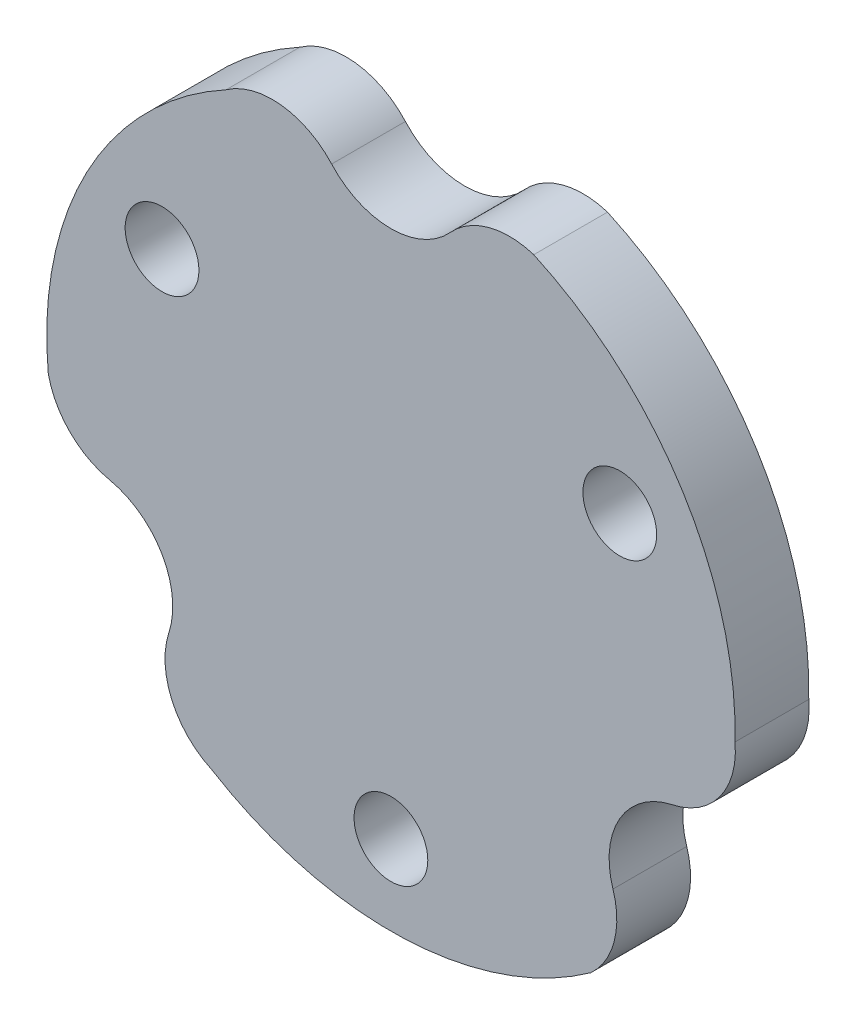
ISO-10303-21;
HEADER;
FILE_DESCRIPTION(('STEP AP214'),'2;1');
FILE_NAME('part.step','',(''),(''),'','','');
FILE_SCHEMA(('AUTOMOTIVE_DESIGN { 1 0 10303 214 1 1 1 1 }'));
ENDSEC;
DATA;
#1=APPLICATION_CONTEXT('core data for automotive mechanical design processes');
#2=APPLICATION_PROTOCOL_DEFINITION('international standard','automotive_design',2000,#1);
#3=PRODUCT_CONTEXT('',#1,'mechanical');
#4=PRODUCT('Part','Part','',(#3));
#5=PRODUCT_RELATED_PRODUCT_CATEGORY('part','',(#4));
#6=PRODUCT_DEFINITION_FORMATION('','',#4);
#7=PRODUCT_DEFINITION_CONTEXT('part definition',#1,'design');
#8=PRODUCT_DEFINITION('design','',#6,#7);
#9=PRODUCT_DEFINITION_SHAPE('','',#8);
#10=(LENGTH_UNIT() NAMED_UNIT(*) SI_UNIT(.MILLI.,.METRE.));
#11=(NAMED_UNIT(*) PLANE_ANGLE_UNIT() SI_UNIT($,.RADIAN.));
#12=(NAMED_UNIT(*) SI_UNIT($,.STERADIAN.) SOLID_ANGLE_UNIT());
#13=UNCERTAINTY_MEASURE_WITH_UNIT(LENGTH_MEASURE(1.E-05),#10,'distance_accuracy_value','');
#14=(GEOMETRIC_REPRESENTATION_CONTEXT(3) GLOBAL_UNCERTAINTY_ASSIGNED_CONTEXT((#13)) GLOBAL_UNIT_ASSIGNED_CONTEXT((#10,
#11,#12)) REPRESENTATION_CONTEXT('',''));
#15=CARTESIAN_POINT('',(0.,0.,0.));
#16=DIRECTION('',(0.,0.,1.));
#17=DIRECTION('',(1.,0.,0.));
#18=AXIS2_PLACEMENT_3D('',#15,#16,#17);
#19=CARTESIAN_POINT('',(5.38035373757222,-0.322325392410559,3.));
#20=DIRECTION('',(0.,0.,1.));
#21=DIRECTION('',(1.,0.,0.));
#22=AXIS2_PLACEMENT_3D('',#19,#20,#21);
#23=PLANE('',#22);
#24=CARTESIAN_POINT('',(0.,-10.75,3.));
#25=DIRECTION('',(0.,0.,1.));
#26=DIRECTION('',(1.,0.,0.));
#27=AXIS2_PLACEMENT_3D('',#24,#25,#26);
#28=CIRCLE('',#27,1.5);
#29=CARTESIAN_POINT('',(1.5,-10.75,3.));
#30=VERTEX_POINT('',#29);
#31=EDGE_CURVE('E285',#30,#30,#28,.T.);
#32=ORIENTED_EDGE('',*,*,#31,.F.);
#33=EDGE_LOOP('',(#32));
#34=FACE_BOUND('',#33,.T.);
#35=CARTESIAN_POINT('',(10.7607074751444,-0.644650784821117,3.));
#36=DIRECTION('',(0.,0.,1.));
#37=DIRECTION('',(1.,0.,0.));
#38=AXIS2_PLACEMENT_3D('',#35,#36,#37);
#39=CIRCLE('',#38,3.25);
#40=CARTESIAN_POINT('',(11.4425315640548,-3.82232539242045,3.));
#41=VERTEX_POINT('',#40);
#42=CARTESIAN_POINT('',(13.9959775932843,-0.335575935195618,3.));
#43=VERTEX_POINT('',#42);
#44=EDGE_CURVE('E176',#41,#43,#39,.T.);
#45=ORIENTED_EDGE('',*,*,#44,.T.);
#46=CARTESIAN_POINT('',(0.,0.,3.));
#47=DIRECTION('',(0.,0.,1.));
#48=DIRECTION('',(1.,0.,0.));
#49=AXIS2_PLACEMENT_3D('',#46,#47,#48);
#50=CIRCLE('',#49,14.);
#51=CARTESIAN_POINT('',(5.80943087987062,12.7377593340432,3.));
#52=VERTEX_POINT('',#51);
#53=EDGE_CURVE('E104',#43,#52,#50,.T.);
#54=ORIENTED_EDGE('',*,*,#53,.T.);
#55=CARTESIAN_POINT('',(4.82206978136234,9.64137142857136,3.));
#56=DIRECTION('',(0.,0.,1.));
#57=DIRECTION('',(1.,0.,0.));
#58=AXIS2_PLACEMENT_3D('',#55,#56,#57);
#59=CIRCLE('',#58,3.25);
#60=CARTESIAN_POINT('',(2.41103489067909,11.8206857142833,3.));
#61=VERTEX_POINT('',#60);
#62=EDGE_CURVE('E203',#52,#61,#59,.T.);
#63=ORIENTED_EDGE('',*,*,#62,.T.);
#64=CARTESIAN_POINT('',(1.07437023516552E-11,13.9999999999817,3.));
#65=DIRECTION('',(0.,0.,-1.));
#66=DIRECTION('',(1.,0.,0.));
#67=AXIS2_PLACEMENT_3D('',#64,#65,#66);
#68=CIRCLE('',#67,3.24999999997992);
#69=CARTESIAN_POINT('',(-2.41103489066096,11.820685714287,3.));
#70=VERTEX_POINT('',#69);
#71=EDGE_CURVE('E222',#61,#70,#68,.T.);
#72=ORIENTED_EDGE('',*,*,#71,.T.);
#73=CARTESIAN_POINT('',(-4.82206978134755,9.64137142857876,3.));
#74=DIRECTION('',(0.,0.,1.));
#75=DIRECTION('',(1.,0.,0.));
#76=AXIS2_PLACEMENT_3D('',#73,#74,#75);
#77=CIRCLE('',#76,3.25);
#78=CARTESIAN_POINT('',(-6.70737151186402,12.2886601141799,3.));
#79=VERTEX_POINT('',#78);
#80=EDGE_CURVE('E219',#70,#79,#77,.T.);
#81=ORIENTED_EDGE('',*,*,#80,.T.);
#82=CARTESIAN_POINT('',(0.,0.,3.));
#83=DIRECTION('',(0.,0.,1.));
#84=DIRECTION('',(1.,0.,0.));
#85=AXIS2_PLACEMENT_3D('',#82,#83,#84);
#86=CIRCLE('',#85,14.);
#87=CARTESIAN_POINT('',(-13.9359386105091,-1.33776494352389,3.));
#88=VERTEX_POINT('',#87);
#89=EDGE_CURVE('E221',#79,#88,#86,.T.);
#90=ORIENTED_EDGE('',*,*,#89,.T.);
#91=CARTESIAN_POINT('',(-10.7607074751454,-0.644650784804622,3.));
#92=DIRECTION('',(0.,0.,1.));
#93=DIRECTION('',(1.,0.,0.));
#94=AXIS2_PLACEMENT_3D('',#91,#92,#93);
#95=CIRCLE('',#94,3.25);
#96=CARTESIAN_POINT('',(-11.4425315640607,-3.82232539240291,3.));
#97=VERTEX_POINT('',#96);
#98=EDGE_CURVE('E224',#88,#97,#95,.T.);
#99=ORIENTED_EDGE('',*,*,#98,.T.);
#100=CARTESIAN_POINT('',(-12.1243556529717,-6.99999999998158,3.));
#101=DIRECTION('',(0.,0.,-1.));
#102=DIRECTION('',(1.,0.,0.));
#103=AXIS2_PLACEMENT_3D('',#100,#101,#102);
#104=CIRCLE('',#103,3.24999999997994);
#105=CARTESIAN_POINT('',(-9.03149667339383,-7.99836032186653,3.));
#106=VERTEX_POINT('',#105);
#107=EDGE_CURVE('E230',#97,#106,#104,.T.);
#108=ORIENTED_EDGE('',*,*,#107,.T.);
#109=CARTESIAN_POINT('',(-5.93863769379688,-8.99672064375764,3.));
#110=DIRECTION('',(0.,0.,1.));
#111=DIRECTION('',(1.,0.,0.));
#112=AXIS2_PLACEMENT_3D('',#109,#110,#111);
#113=CIRCLE('',#112,3.25);
#114=CARTESIAN_POINT('',(-7.28860608142029,-11.9530841789842,3.));
#115=VERTEX_POINT('',#114);
#116=EDGE_CURVE('E135',#106,#115,#113,.T.);
#117=ORIENTED_EDGE('',*,*,#116,.T.);
#118=CARTESIAN_POINT('',(0.,0.,3.));
#119=DIRECTION('',(0.,0.,1.));
#120=DIRECTION('',(1.,0.,0.));
#121=AXIS2_PLACEMENT_3D('',#118,#119,#120);
#122=CIRCLE('',#121,14.);
#123=CARTESIAN_POINT('',(8.12650773063849,-11.3999943905194,3.));
#124=VERTEX_POINT('',#123);
#125=EDGE_CURVE('E129',#115,#124,#122,.T.);
#126=ORIENTED_EDGE('',*,*,#125,.T.);
#127=CARTESIAN_POINT('',(5.93863769378309,-8.99672064376674,3.));
#128=DIRECTION('',(0.,0.,1.));
#129=DIRECTION('',(1.,0.,0.));
#130=AXIS2_PLACEMENT_3D('',#127,#128,#129);
#131=CIRCLE('',#130,3.25);
#132=CARTESIAN_POINT('',(9.03149667338157,-7.99836032188037,3.));
#133=VERTEX_POINT('',#132);
#134=EDGE_CURVE('E133',#124,#133,#131,.T.);
#135=ORIENTED_EDGE('',*,*,#134,.T.);
#136=CARTESIAN_POINT('',(12.124355652961,-7.00000000000017,3.));
#137=DIRECTION('',(0.,0.,-1.));
#138=DIRECTION('',(1.,0.,0.));
#139=AXIS2_PLACEMENT_3D('',#136,#137,#138);
#140=CIRCLE('',#139,3.24999999997994);
#141=EDGE_CURVE('E49',#133,#41,#140,.T.);
#142=ORIENTED_EDGE('',*,*,#141,.T.);
#143=EDGE_LOOP('',(#45,#54,#63,#72,#81,#90,#99,#108,#117,#126,#135,#142));
#144=FACE_BOUND('',#143,.T.);
#145=CARTESIAN_POINT('',(9.30977309068262,5.37500000000016,3.));
#146=DIRECTION('',(0.,0.,1.));
#147=DIRECTION('',(1.,0.,0.));
#148=AXIS2_PLACEMENT_3D('',#145,#146,#147);
#149=CIRCLE('',#148,1.5);
#150=CARTESIAN_POINT('',(10.8097730906826,5.37500000000016,3.));
#151=VERTEX_POINT('',#150);
#152=EDGE_CURVE('E157',#151,#151,#149,.T.);
#153=ORIENTED_EDGE('',*,*,#152,.F.);
#154=EDGE_LOOP('',(#153));
#155=FACE_BOUND('',#154,.T.);
#156=CARTESIAN_POINT('',(-9.30977309068277,5.37499999999991,3.));
#157=DIRECTION('',(0.,0.,1.));
#158=DIRECTION('',(1.,0.,0.));
#159=AXIS2_PLACEMENT_3D('',#156,#157,#158);
#160=CIRCLE('',#159,1.5);
#161=CARTESIAN_POINT('',(-7.80977309068277,5.37499999999991,3.));
#162=VERTEX_POINT('',#161);
#163=EDGE_CURVE('E276',#162,#162,#160,.T.);
#164=ORIENTED_EDGE('',*,*,#163,.F.);
#165=EDGE_LOOP('',(#164));
#166=FACE_BOUND('',#165,.T.);
#167=ADVANCED_FACE('F32',(#34,#144,#155,#166),#23,.T.);
#168=CARTESIAN_POINT('',(5.38035373757222,-0.322325392410559,0.));
#169=DIRECTION('',(0.,0.,1.));
#170=DIRECTION('',(1.,0.,0.));
#171=AXIS2_PLACEMENT_3D('',#168,#169,#170);
#172=PLANE('',#171);
#173=CARTESIAN_POINT('',(10.7607074751444,-0.644650784821117,0.));
#174=DIRECTION('',(0.,0.,1.));
#175=DIRECTION('',(1.,0.,0.));
#176=AXIS2_PLACEMENT_3D('',#173,#174,#175);
#177=CIRCLE('',#176,3.25);
#178=CARTESIAN_POINT('',(11.4425315640548,-3.82232539242045,0.));
#179=VERTEX_POINT('',#178);
#180=CARTESIAN_POINT('',(13.9959775932843,-0.335575935195618,0.));
#181=VERTEX_POINT('',#180);
#182=EDGE_CURVE('E153',#179,#181,#177,.T.);
#183=ORIENTED_EDGE('',*,*,#182,.F.);
#184=CARTESIAN_POINT('',(12.124355652961,-7.00000000000017,0.));
#185=DIRECTION('',(0.,0.,-1.));
#186=DIRECTION('',(1.,0.,0.));
#187=AXIS2_PLACEMENT_3D('',#184,#185,#186);
#188=CIRCLE('',#187,3.24999999997994);
#189=CARTESIAN_POINT('',(9.03149667338157,-7.99836032188037,0.));
#190=VERTEX_POINT('',#189);
#191=EDGE_CURVE('E96',#190,#179,#188,.T.);
#192=ORIENTED_EDGE('',*,*,#191,.F.);
#193=CARTESIAN_POINT('',(5.93863769378309,-8.99672064376674,0.));
#194=DIRECTION('',(0.,0.,1.));
#195=DIRECTION('',(1.,0.,0.));
#196=AXIS2_PLACEMENT_3D('',#193,#194,#195);
#197=CIRCLE('',#196,3.25);
#198=CARTESIAN_POINT('',(8.12650773063849,-11.3999943905194,0.));
#199=VERTEX_POINT('',#198);
#200=EDGE_CURVE('E90',#199,#190,#197,.T.);
#201=ORIENTED_EDGE('',*,*,#200,.F.);
#202=CARTESIAN_POINT('',(0.,0.,0.));
#203=DIRECTION('',(0.,0.,1.));
#204=DIRECTION('',(1.,0.,0.));
#205=AXIS2_PLACEMENT_3D('',#202,#203,#204);
#206=CIRCLE('',#205,14.);
#207=CARTESIAN_POINT('',(-7.28860608142029,-11.9530841789842,0.));
#208=VERTEX_POINT('',#207);
#209=EDGE_CURVE('E143',#208,#199,#206,.T.);
#210=ORIENTED_EDGE('',*,*,#209,.F.);
#211=CARTESIAN_POINT('',(-5.93863769379688,-8.99672064375764,0.));
#212=DIRECTION('',(0.,0.,1.));
#213=DIRECTION('',(1.,0.,0.));
#214=AXIS2_PLACEMENT_3D('',#211,#212,#213);
#215=CIRCLE('',#214,3.25);
#216=CARTESIAN_POINT('',(-9.03149667339383,-7.99836032186653,0.));
#217=VERTEX_POINT('',#216);
#218=EDGE_CURVE('E171',#217,#208,#215,.T.);
#219=ORIENTED_EDGE('',*,*,#218,.F.);
#220=CARTESIAN_POINT('',(-12.1243556529717,-6.99999999998158,0.));
#221=DIRECTION('',(0.,0.,-1.));
#222=DIRECTION('',(1.,0.,0.));
#223=AXIS2_PLACEMENT_3D('',#220,#221,#222);
#224=CIRCLE('',#223,3.24999999997994);
#225=CARTESIAN_POINT('',(-11.4425315640607,-3.82232539240291,0.));
#226=VERTEX_POINT('',#225);
#227=EDGE_CURVE('E169',#226,#217,#224,.T.);
#228=ORIENTED_EDGE('',*,*,#227,.F.);
#229=CARTESIAN_POINT('',(-10.7607074751454,-0.644650784804622,0.));
#230=DIRECTION('',(0.,0.,1.));
#231=DIRECTION('',(1.,0.,0.));
#232=AXIS2_PLACEMENT_3D('',#229,#230,#231);
#233=CIRCLE('',#232,3.25);
#234=CARTESIAN_POINT('',(-13.9359386105091,-1.33776494352389,0.));
#235=VERTEX_POINT('',#234);
#236=EDGE_CURVE('E167',#235,#226,#233,.T.);
#237=ORIENTED_EDGE('',*,*,#236,.F.);
#238=CARTESIAN_POINT('',(0.,0.,0.));
#239=DIRECTION('',(0.,0.,1.));
#240=DIRECTION('',(1.,0.,0.));
#241=AXIS2_PLACEMENT_3D('',#238,#239,#240);
#242=CIRCLE('',#241,14.);
#243=CARTESIAN_POINT('',(-6.70737151186402,12.2886601141799,0.));
#244=VERTEX_POINT('',#243);
#245=EDGE_CURVE('E165',#244,#235,#242,.T.);
#246=ORIENTED_EDGE('',*,*,#245,.F.);
#247=CARTESIAN_POINT('',(-4.82206978134755,9.64137142857876,0.));
#248=DIRECTION('',(0.,0.,1.));
#249=DIRECTION('',(1.,0.,0.));
#250=AXIS2_PLACEMENT_3D('',#247,#248,#249);
#251=CIRCLE('',#250,3.25);
#252=CARTESIAN_POINT('',(-2.41103489066096,11.820685714287,0.));
#253=VERTEX_POINT('',#252);
#254=EDGE_CURVE('E163',#253,#244,#251,.T.);
#255=ORIENTED_EDGE('',*,*,#254,.F.);
#256=CARTESIAN_POINT('',(1.07437023516552E-11,13.9999999999817,0.));
#257=DIRECTION('',(0.,0.,-1.));
#258=DIRECTION('',(1.,0.,0.));
#259=AXIS2_PLACEMENT_3D('',#256,#257,#258);
#260=CIRCLE('',#259,3.24999999997992);
#261=CARTESIAN_POINT('',(2.41103489067909,11.8206857142833,0.));
#262=VERTEX_POINT('',#261);
#263=EDGE_CURVE('E161',#262,#253,#260,.T.);
#264=ORIENTED_EDGE('',*,*,#263,.F.);
#265=CARTESIAN_POINT('',(4.82206978136234,9.64137142857136,0.));
#266=DIRECTION('',(0.,0.,1.));
#267=DIRECTION('',(1.,0.,0.));
#268=AXIS2_PLACEMENT_3D('',#265,#266,#267);
#269=CIRCLE('',#268,3.25);
#270=CARTESIAN_POINT('',(5.80943087987062,12.7377593340432,0.));
#271=VERTEX_POINT('',#270);
#272=EDGE_CURVE('E159',#271,#262,#269,.T.);
#273=ORIENTED_EDGE('',*,*,#272,.F.);
#274=CARTESIAN_POINT('',(0.,0.,0.));
#275=DIRECTION('',(0.,0.,1.));
#276=DIRECTION('',(1.,0.,0.));
#277=AXIS2_PLACEMENT_3D('',#274,#275,#276);
#278=CIRCLE('',#277,14.);
#279=EDGE_CURVE('E156',#181,#271,#278,.T.);
#280=ORIENTED_EDGE('',*,*,#279,.F.);
#281=EDGE_LOOP('',(#183,#192,#201,#210,#219,#228,#237,#246,#255,#264,#273,#280));
#282=FACE_BOUND('',#281,.T.);
#283=CARTESIAN_POINT('',(9.30977309068262,5.37500000000016,0.));
#284=DIRECTION('',(0.,0.,1.));
#285=DIRECTION('',(1.,0.,0.));
#286=AXIS2_PLACEMENT_3D('',#283,#284,#285);
#287=CIRCLE('',#286,1.5);
#288=CARTESIAN_POINT('',(10.8097730906826,5.37500000000016,0.));
#289=VERTEX_POINT('',#288);
#290=EDGE_CURVE('E288',#289,#289,#287,.T.);
#291=ORIENTED_EDGE('',*,*,#290,.T.);
#292=EDGE_LOOP('',(#291));
#293=FACE_BOUND('',#292,.T.);
#294=CARTESIAN_POINT('',(0.,-10.75,0.));
#295=DIRECTION('',(0.,0.,1.));
#296=DIRECTION('',(1.,0.,0.));
#297=AXIS2_PLACEMENT_3D('',#294,#295,#296);
#298=CIRCLE('',#297,1.5);
#299=CARTESIAN_POINT('',(1.5,-10.75,0.));
#300=VERTEX_POINT('',#299);
#301=EDGE_CURVE('E282',#300,#300,#298,.T.);
#302=ORIENTED_EDGE('',*,*,#301,.T.);
#303=EDGE_LOOP('',(#302));
#304=FACE_BOUND('',#303,.T.);
#305=CARTESIAN_POINT('',(-9.30977309068277,5.37499999999991,0.));
#306=DIRECTION('',(0.,0.,1.));
#307=DIRECTION('',(1.,0.,0.));
#308=AXIS2_PLACEMENT_3D('',#305,#306,#307);
#309=CIRCLE('',#308,1.5);
#310=CARTESIAN_POINT('',(-7.80977309068277,5.37499999999991,0.));
#311=VERTEX_POINT('',#310);
#312=EDGE_CURVE('E279',#311,#311,#309,.T.);
#313=ORIENTED_EDGE('',*,*,#312,.T.);
#314=EDGE_LOOP('',(#313));
#315=FACE_BOUND('',#314,.T.);
#316=ADVANCED_FACE('F207',(#282,#293,#304,#315),#172,.F.);
#317=CARTESIAN_POINT('',(10.7607074751444,-0.644650784821117,3.));
#318=DIRECTION('',(0.,0.,-1.));
#319=DIRECTION('',(-1.,0.,0.));
#320=AXIS2_PLACEMENT_3D('',#317,#318,#319);
#321=CYLINDRICAL_SURFACE('',#320,3.25);
#322=ORIENTED_EDGE('',*,*,#182,.T.);
#323=DIRECTION('',(0.,0.,-1.));
#324=VECTOR('',#323,1.);
#325=CARTESIAN_POINT('',(13.9959775932843,-0.335575935195618,3.));
#326=LINE('',#325,#324);
#327=EDGE_CURVE('E11',#43,#181,#326,.T.);
#328=ORIENTED_EDGE('',*,*,#327,.F.);
#329=ORIENTED_EDGE('',*,*,#44,.F.);
#330=DIRECTION('',(0.,0.,-1.));
#331=VECTOR('',#330,1.);
#332=CARTESIAN_POINT('',(11.4425315640548,-3.82232539242045,3.));
#333=LINE('',#332,#331);
#334=EDGE_CURVE('E149',#41,#179,#333,.T.);
#335=ORIENTED_EDGE('',*,*,#334,.T.);
#336=EDGE_LOOP('',(#322,#328,#329,#335));
#337=FACE_BOUND('',#336,.T.);
#338=ADVANCED_FACE('F34',(#337),#321,.T.);
#339=CARTESIAN_POINT('',(0.,0.,3.));
#340=DIRECTION('',(0.,0.,-1.));
#341=DIRECTION('',(-1.,0.,0.));
#342=AXIS2_PLACEMENT_3D('',#339,#340,#341);
#343=CYLINDRICAL_SURFACE('',#342,14.);
#344=ORIENTED_EDGE('',*,*,#279,.T.);
#345=DIRECTION('',(0.,0.,-1.));
#346=VECTOR('',#345,1.);
#347=CARTESIAN_POINT('',(5.80943087987062,12.7377593340432,3.));
#348=LINE('',#347,#346);
#349=EDGE_CURVE('E41',#52,#271,#348,.T.);
#350=ORIENTED_EDGE('',*,*,#349,.F.);
#351=ORIENTED_EDGE('',*,*,#53,.F.);
#352=ORIENTED_EDGE('',*,*,#327,.T.);
#353=EDGE_LOOP('',(#344,#350,#351,#352));
#354=FACE_BOUND('',#353,.T.);
#355=ADVANCED_FACE('F390',(#354),#343,.T.);
#356=CARTESIAN_POINT('',(4.82206978136234,9.64137142857136,3.));
#357=DIRECTION('',(0.,0.,-1.));
#358=DIRECTION('',(-1.,0.,0.));
#359=AXIS2_PLACEMENT_3D('',#356,#357,#358);
#360=CYLINDRICAL_SURFACE('',#359,3.25);
#361=ORIENTED_EDGE('',*,*,#272,.T.);
#362=DIRECTION('',(0.,0.,-1.));
#363=VECTOR('',#362,1.);
#364=CARTESIAN_POINT('',(2.41103489067909,11.8206857142833,3.));
#365=LINE('',#364,#363);
#366=EDGE_CURVE('E195',#61,#262,#365,.T.);
#367=ORIENTED_EDGE('',*,*,#366,.F.);
#368=ORIENTED_EDGE('',*,*,#62,.F.);
#369=ORIENTED_EDGE('',*,*,#349,.T.);
#370=EDGE_LOOP('',(#361,#367,#368,#369));
#371=FACE_BOUND('',#370,.T.);
#372=ADVANCED_FACE('F201',(#371),#360,.T.);
#373=CARTESIAN_POINT('',(1.07437023516552E-11,13.9999999999817,3.));
#374=DIRECTION('',(0.,0.,-1.));
#375=DIRECTION('',(-1.,0.,0.));
#376=AXIS2_PLACEMENT_3D('',#373,#374,#375);
#377=CYLINDRICAL_SURFACE('',#376,3.24999999997992);
#378=ORIENTED_EDGE('',*,*,#263,.T.);
#379=DIRECTION('',(0.,0.,-1.));
#380=VECTOR('',#379,1.);
#381=CARTESIAN_POINT('',(-2.41103489066096,11.820685714287,3.));
#382=LINE('',#381,#380);
#383=EDGE_CURVE('E192',#70,#253,#382,.T.);
#384=ORIENTED_EDGE('',*,*,#383,.F.);
#385=ORIENTED_EDGE('',*,*,#71,.F.);
#386=ORIENTED_EDGE('',*,*,#366,.T.);
#387=EDGE_LOOP('',(#378,#384,#385,#386));
#388=FACE_BOUND('',#387,.T.);
#389=ADVANCED_FACE('F213',(#388),#377,.F.);
#390=CARTESIAN_POINT('',(-4.82206978134755,9.64137142857876,3.));
#391=DIRECTION('',(0.,0.,-1.));
#392=DIRECTION('',(-1.,0.,0.));
#393=AXIS2_PLACEMENT_3D('',#390,#391,#392);
#394=CYLINDRICAL_SURFACE('',#393,3.25);
#395=ORIENTED_EDGE('',*,*,#254,.T.);
#396=DIRECTION('',(0.,0.,-1.));
#397=VECTOR('',#396,1.);
#398=CARTESIAN_POINT('',(-6.70737151186402,12.2886601141799,3.));
#399=LINE('',#398,#397);
#400=EDGE_CURVE('E189',#79,#244,#399,.T.);
#401=ORIENTED_EDGE('',*,*,#400,.F.);
#402=ORIENTED_EDGE('',*,*,#80,.F.);
#403=ORIENTED_EDGE('',*,*,#383,.T.);
#404=EDGE_LOOP('',(#395,#401,#402,#403));
#405=FACE_BOUND('',#404,.T.);
#406=ADVANCED_FACE('F217',(#405),#394,.T.);
#407=CARTESIAN_POINT('',(0.,0.,3.));
#408=DIRECTION('',(0.,0.,-1.));
#409=DIRECTION('',(-1.,0.,0.));
#410=AXIS2_PLACEMENT_3D('',#407,#408,#409);
#411=CYLINDRICAL_SURFACE('',#410,14.);
#412=ORIENTED_EDGE('',*,*,#245,.T.);
#413=DIRECTION('',(0.,0.,-1.));
#414=VECTOR('',#413,1.);
#415=CARTESIAN_POINT('',(-13.9359386105091,-1.33776494352389,3.));
#416=LINE('',#415,#414);
#417=EDGE_CURVE('E186',#88,#235,#416,.T.);
#418=ORIENTED_EDGE('',*,*,#417,.F.);
#419=ORIENTED_EDGE('',*,*,#89,.F.);
#420=ORIENTED_EDGE('',*,*,#400,.T.);
#421=EDGE_LOOP('',(#412,#418,#419,#420));
#422=FACE_BOUND('',#421,.T.);
#423=ADVANCED_FACE('F355',(#422),#411,.T.);
#424=CARTESIAN_POINT('',(-10.7607074751454,-0.644650784804622,3.));
#425=DIRECTION('',(0.,0.,-1.));
#426=DIRECTION('',(-1.,0.,0.));
#427=AXIS2_PLACEMENT_3D('',#424,#425,#426);
#428=CYLINDRICAL_SURFACE('',#427,3.25);
#429=ORIENTED_EDGE('',*,*,#236,.T.);
#430=DIRECTION('',(0.,0.,-1.));
#431=VECTOR('',#430,1.);
#432=CARTESIAN_POINT('',(-11.4425315640607,-3.82232539240291,3.));
#433=LINE('',#432,#431);
#434=EDGE_CURVE('E183',#97,#226,#433,.T.);
#435=ORIENTED_EDGE('',*,*,#434,.F.);
#436=ORIENTED_EDGE('',*,*,#98,.F.);
#437=ORIENTED_EDGE('',*,*,#417,.T.);
#438=EDGE_LOOP('',(#429,#435,#436,#437));
#439=FACE_BOUND('',#438,.T.);
#440=ADVANCED_FACE('F346',(#439),#428,.T.);
#441=CARTESIAN_POINT('',(-12.1243556529717,-6.99999999998158,3.));
#442=DIRECTION('',(0.,0.,-1.));
#443=DIRECTION('',(-1.,0.,0.));
#444=AXIS2_PLACEMENT_3D('',#441,#442,#443);
#445=CYLINDRICAL_SURFACE('',#444,3.24999999997994);
#446=ORIENTED_EDGE('',*,*,#227,.T.);
#447=DIRECTION('',(0.,0.,-1.));
#448=VECTOR('',#447,1.);
#449=CARTESIAN_POINT('',(-9.03149667339383,-7.99836032186653,3.));
#450=LINE('',#449,#448);
#451=EDGE_CURVE('E180',#106,#217,#450,.T.);
#452=ORIENTED_EDGE('',*,*,#451,.F.);
#453=ORIENTED_EDGE('',*,*,#107,.F.);
#454=ORIENTED_EDGE('',*,*,#434,.T.);
#455=EDGE_LOOP('',(#446,#452,#453,#454));
#456=FACE_BOUND('',#455,.T.);
#457=ADVANCED_FACE('F236',(#456),#445,.F.);
#458=CARTESIAN_POINT('',(-5.93863769379688,-8.99672064375764,3.));
#459=DIRECTION('',(0.,0.,-1.));
#460=DIRECTION('',(-1.,0.,0.));
#461=AXIS2_PLACEMENT_3D('',#458,#459,#460);
#462=CYLINDRICAL_SURFACE('',#461,3.25);
#463=ORIENTED_EDGE('',*,*,#218,.T.);
#464=DIRECTION('',(0.,0.,-1.));
#465=VECTOR('',#464,1.);
#466=CARTESIAN_POINT('',(-7.28860608142029,-11.9530841789842,3.));
#467=LINE('',#466,#465);
#468=EDGE_CURVE('E144',#115,#208,#467,.T.);
#469=ORIENTED_EDGE('',*,*,#468,.F.);
#470=ORIENTED_EDGE('',*,*,#116,.F.);
#471=ORIENTED_EDGE('',*,*,#451,.T.);
#472=EDGE_LOOP('',(#463,#469,#470,#471));
#473=FACE_BOUND('',#472,.T.);
#474=ADVANCED_FACE('F240',(#473),#462,.T.);
#475=CARTESIAN_POINT('',(0.,0.,3.));
#476=DIRECTION('',(0.,0.,-1.));
#477=DIRECTION('',(-1.,0.,0.));
#478=AXIS2_PLACEMENT_3D('',#475,#476,#477);
#479=CYLINDRICAL_SURFACE('',#478,14.);
#480=ORIENTED_EDGE('',*,*,#209,.T.);
#481=DIRECTION('',(0.,0.,-1.));
#482=VECTOR('',#481,1.);
#483=CARTESIAN_POINT('',(8.12650773063849,-11.3999943905194,3.));
#484=LINE('',#483,#482);
#485=EDGE_CURVE('E140',#124,#199,#484,.T.);
#486=ORIENTED_EDGE('',*,*,#485,.F.);
#487=ORIENTED_EDGE('',*,*,#125,.F.);
#488=ORIENTED_EDGE('',*,*,#468,.T.);
#489=EDGE_LOOP('',(#480,#486,#487,#488));
#490=FACE_BOUND('',#489,.T.);
#491=ADVANCED_FACE('F141',(#490),#479,.T.);
#492=CARTESIAN_POINT('',(5.93863769378309,-8.99672064376674,3.));
#493=DIRECTION('',(0.,0.,-1.));
#494=DIRECTION('',(-1.,0.,0.));
#495=AXIS2_PLACEMENT_3D('',#492,#493,#494);
#496=CYLINDRICAL_SURFACE('',#495,3.25);
#497=ORIENTED_EDGE('',*,*,#200,.T.);
#498=DIRECTION('',(0.,0.,-1.));
#499=VECTOR('',#498,1.);
#500=CARTESIAN_POINT('',(9.03149667338157,-7.99836032188037,3.));
#501=LINE('',#500,#499);
#502=EDGE_CURVE('E145',#133,#190,#501,.T.);
#503=ORIENTED_EDGE('',*,*,#502,.F.);
#504=ORIENTED_EDGE('',*,*,#134,.F.);
#505=ORIENTED_EDGE('',*,*,#485,.T.);
#506=EDGE_LOOP('',(#497,#503,#504,#505));
#507=FACE_BOUND('',#506,.T.);
#508=ADVANCED_FACE('F147',(#507),#496,.T.);
#509=CARTESIAN_POINT('',(12.124355652961,-7.00000000000017,3.));
#510=DIRECTION('',(0.,0.,-1.));
#511=DIRECTION('',(-1.,0.,0.));
#512=AXIS2_PLACEMENT_3D('',#509,#510,#511);
#513=CYLINDRICAL_SURFACE('',#512,3.24999999997994);
#514=ORIENTED_EDGE('',*,*,#191,.T.);
#515=ORIENTED_EDGE('',*,*,#334,.F.);
#516=ORIENTED_EDGE('',*,*,#141,.F.);
#517=ORIENTED_EDGE('',*,*,#502,.T.);
#518=EDGE_LOOP('',(#514,#515,#516,#517));
#519=FACE_BOUND('',#518,.T.);
#520=ADVANCED_FACE('F244',(#519),#513,.F.);
#521=CARTESIAN_POINT('',(9.30977309068262,5.37500000000016,3.));
#522=DIRECTION('',(0.,0.,-1.));
#523=DIRECTION('',(-1.,0.,0.));
#524=AXIS2_PLACEMENT_3D('',#521,#522,#523);
#525=CYLINDRICAL_SURFACE('',#524,1.5);
#526=ORIENTED_EDGE('',*,*,#152,.T.);
#527=EDGE_LOOP('',(#526));
#528=FACE_BOUND('',#527,.T.);
#529=ORIENTED_EDGE('',*,*,#290,.F.);
#530=EDGE_LOOP('',(#529));
#531=FACE_BOUND('',#530,.T.);
#532=ADVANCED_FACE('F246',(#528,#531),#525,.F.);
#533=CARTESIAN_POINT('',(0.,-10.75,3.));
#534=DIRECTION('',(0.,0.,-1.));
#535=DIRECTION('',(-1.,0.,0.));
#536=AXIS2_PLACEMENT_3D('',#533,#534,#535);
#537=CYLINDRICAL_SURFACE('',#536,1.5);
#538=ORIENTED_EDGE('',*,*,#31,.T.);
#539=EDGE_LOOP('',(#538));
#540=FACE_BOUND('',#539,.T.);
#541=ORIENTED_EDGE('',*,*,#301,.F.);
#542=EDGE_LOOP('',(#541));
#543=FACE_BOUND('',#542,.T.);
#544=ADVANCED_FACE('F252',(#540,#543),#537,.F.);
#545=CARTESIAN_POINT('',(-9.30977309068277,5.37499999999991,3.));
#546=DIRECTION('',(0.,0.,-1.));
#547=DIRECTION('',(-1.,0.,0.));
#548=AXIS2_PLACEMENT_3D('',#545,#546,#547);
#549=CYLINDRICAL_SURFACE('',#548,1.5);
#550=ORIENTED_EDGE('',*,*,#163,.T.);
#551=EDGE_LOOP('',(#550));
#552=FACE_BOUND('',#551,.T.);
#553=ORIENTED_EDGE('',*,*,#312,.F.);
#554=EDGE_LOOP('',(#553));
#555=FACE_BOUND('',#554,.T.);
#556=ADVANCED_FACE('F267',(#552,#555),#549,.F.);
#557=CLOSED_SHELL('',(#167,#316,#338,#355,#372,#389,#406,#423,#440,#457,#474,#491,#508,#520,
#532,#544,#556));
#558=MANIFOLD_SOLID_BREP('B2',#557);
#559=ADVANCED_BREP_SHAPE_REPRESENTATION('',(#18,#558),#14);
#560=SHAPE_DEFINITION_REPRESENTATION(#9,#559);
ENDSEC;
END-ISO-10303-21;
